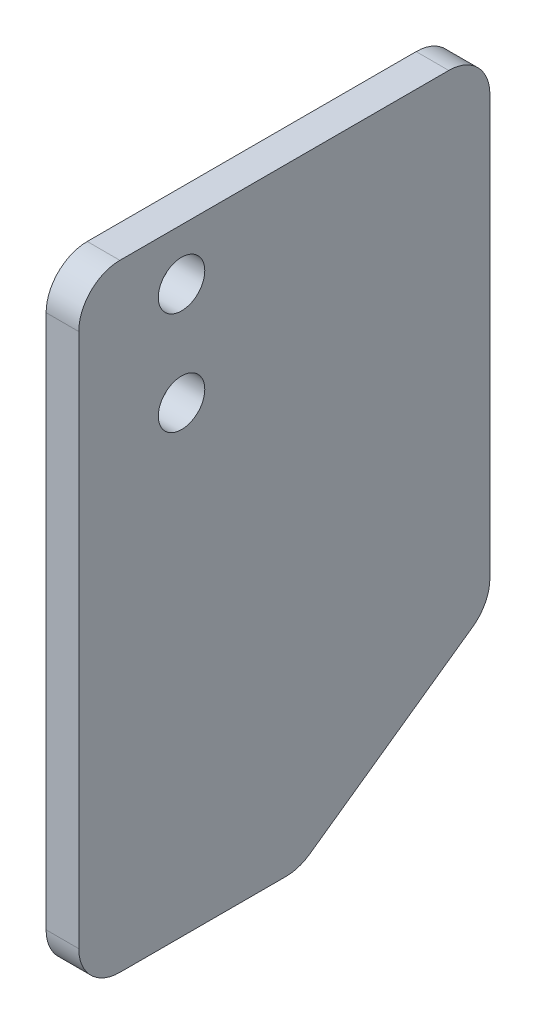
ISO-10303-21;
HEADER;
FILE_DESCRIPTION(('STEP AP214'),'2;1');
FILE_NAME('part.step','',(''),(''),'','','');
FILE_SCHEMA(('AUTOMOTIVE_DESIGN { 1 0 10303 214 1 1 1 1 }'));
ENDSEC;
DATA;
#1=APPLICATION_CONTEXT('core data for automotive mechanical design processes');
#2=APPLICATION_PROTOCOL_DEFINITION('international standard','automotive_design',2000,#1);
#3=PRODUCT_CONTEXT('',#1,'mechanical');
#4=PRODUCT('Part','Part','',(#3));
#5=PRODUCT_RELATED_PRODUCT_CATEGORY('part','',(#4));
#6=PRODUCT_DEFINITION_FORMATION('','',#4);
#7=PRODUCT_DEFINITION_CONTEXT('part definition',#1,'design');
#8=PRODUCT_DEFINITION('design','',#6,#7);
#9=PRODUCT_DEFINITION_SHAPE('','',#8);
#10=(LENGTH_UNIT() NAMED_UNIT(*) SI_UNIT(.MILLI.,.METRE.));
#11=(NAMED_UNIT(*) PLANE_ANGLE_UNIT() SI_UNIT($,.RADIAN.));
#12=(NAMED_UNIT(*) SI_UNIT($,.STERADIAN.) SOLID_ANGLE_UNIT());
#13=UNCERTAINTY_MEASURE_WITH_UNIT(LENGTH_MEASURE(1.E-05),#10,'distance_accuracy_value','');
#14=(GEOMETRIC_REPRESENTATION_CONTEXT(3) GLOBAL_UNCERTAINTY_ASSIGNED_CONTEXT((#13)) GLOBAL_UNIT_ASSIGNED_CONTEXT((#10,
#11,#12)) REPRESENTATION_CONTEXT('',''));
#15=CARTESIAN_POINT('',(0.,0.,0.));
#16=DIRECTION('',(0.,0.,1.));
#17=DIRECTION('',(1.,0.,0.));
#18=AXIS2_PLACEMENT_3D('',#15,#16,#17);
#19=CARTESIAN_POINT('',(0.79425,-38.795,-5.07828951110299));
#20=DIRECTION('',(-1.,0.,0.));
#21=DIRECTION('',(0.,0.,1.));
#22=AXIS2_PLACEMENT_3D('',#19,#20,#21);
#23=CYLINDRICAL_SURFACE('',#22,2.);
#24=CARTESIAN_POINT('',(-0.79375,-38.795,-5.07828951110299));
#25=DIRECTION('',(-1.,0.,0.));
#26=DIRECTION('',(0.,0.,1.));
#27=AXIS2_PLACEMENT_3D('',#24,#25,#26);
#28=CIRCLE('',#27,2.);
#29=CARTESIAN_POINT('',(-0.79375,-40.4279931618554,-6.23299004948226));
#30=VERTEX_POINT('',#29);
#31=CARTESIAN_POINT('',(-0.79375,-40.795,-5.07828951110299));
#32=VERTEX_POINT('',#31);
#33=EDGE_CURVE('E154',#30,#32,#28,.T.);
#34=ORIENTED_EDGE('',*,*,#33,.F.);
#35=DIRECTION('',(-1.,0.,0.));
#36=VECTOR('',#35,1.);
#37=CARTESIAN_POINT('',(0.79425,-40.4279931618554,-6.23299004948226));
#38=LINE('',#37,#36);
#39=CARTESIAN_POINT('',(0.79425,-40.4279931618554,-6.23299004948226));
#40=VERTEX_POINT('',#39);
#41=EDGE_CURVE('E11',#40,#30,#38,.T.);
#42=ORIENTED_EDGE('',*,*,#41,.F.);
#43=CARTESIAN_POINT('',(0.79425,-38.795,-5.07828951110299));
#44=DIRECTION('',(-1.,0.,0.));
#45=DIRECTION('',(0.,0.,1.));
#46=AXIS2_PLACEMENT_3D('',#43,#44,#45);
#47=CIRCLE('',#46,2.);
#48=CARTESIAN_POINT('',(0.79425,-40.795,-5.07828951110299));
#49=VERTEX_POINT('',#48);
#50=EDGE_CURVE('E191',#40,#49,#47,.T.);
#51=ORIENTED_EDGE('',*,*,#50,.T.);
#52=DIRECTION('',(-1.,0.,0.));
#53=VECTOR('',#52,1.);
#54=CARTESIAN_POINT('',(0.79425,-40.795,-5.07828951110299));
#55=LINE('',#54,#53);
#56=EDGE_CURVE('E42',#49,#32,#55,.T.);
#57=ORIENTED_EDGE('',*,*,#56,.T.);
#58=EDGE_LOOP('',(#34,#42,#51,#57));
#59=FACE_BOUND('',#58,.T.);
#60=ADVANCED_FACE('F39',(#59),#23,.T.);
#61=CARTESIAN_POINT('',(0.794250000000003,-34.8264979565598,-14.1547005383793));
#62=DIRECTION('',(0.,-0.816496580927726,-0.577350269189625));
#63=DIRECTION('',(0.,0.577350269189625,-0.816496580927726));
#64=AXIS2_PLACEMENT_3D('',#61,#62,#63);
#65=PLANE('',#64);
#66=DIRECTION('',(0.,-0.577350269189625,0.816496580927726));
#67=VECTOR('',#66,1.);
#68=CARTESIAN_POINT('',(-0.793749999999997,-34.8264979565598,-14.1547005383793));
#69=LINE('',#68,#67);
#70=CARTESIAN_POINT('',(-0.793749999999997,-34.8264979565598,-14.1547005383793));
#71=VERTEX_POINT('',#70);
#72=EDGE_CURVE('E188',#71,#30,#69,.T.);
#73=ORIENTED_EDGE('',*,*,#72,.F.);
#74=DIRECTION('',(-1.,0.,0.));
#75=VECTOR('',#74,1.);
#76=CARTESIAN_POINT('',(0.794250000000003,-34.8264979565598,-14.1547005383793));
#77=LINE('',#76,#75);
#78=CARTESIAN_POINT('',(0.794250000000003,-34.8264979565598,-14.1547005383793));
#79=VERTEX_POINT('',#78);
#80=EDGE_CURVE('E49',#79,#71,#77,.T.);
#81=ORIENTED_EDGE('',*,*,#80,.F.);
#82=DIRECTION('',(0.,-0.577350269189625,0.816496580927726));
#83=VECTOR('',#82,1.);
#84=CARTESIAN_POINT('',(0.794250000000003,-34.8264979565598,-14.1547005383793));
#85=LINE('',#84,#83);
#86=EDGE_CURVE('E140',#79,#40,#85,.T.);
#87=ORIENTED_EDGE('',*,*,#86,.T.);
#88=ORIENTED_EDGE('',*,*,#41,.T.);
#89=EDGE_LOOP('',(#73,#81,#87,#88));
#90=FACE_BOUND('',#89,.T.);
#91=ADVANCED_FACE('F215',(#90),#65,.T.);
#92=CARTESIAN_POINT('',(0.794250000000003,-33.1935047947043,-13.));
#93=DIRECTION('',(-1.,0.,0.));
#94=DIRECTION('',(0.,0.,1.));
#95=AXIS2_PLACEMENT_3D('',#92,#93,#94);
#96=CYLINDRICAL_SURFACE('',#95,2.00000000000001);
#97=CARTESIAN_POINT('',(-0.793749999999998,-33.1935047947043,-13.));
#98=DIRECTION('',(-1.,0.,0.));
#99=DIRECTION('',(0.,0.,1.));
#100=AXIS2_PLACEMENT_3D('',#97,#98,#99);
#101=CIRCLE('',#100,2.00000000000001);
#102=CARTESIAN_POINT('',(-0.793749999999997,-33.1935047947043,-15.));
#103=VERTEX_POINT('',#102);
#104=EDGE_CURVE('E126',#103,#71,#101,.T.);
#105=ORIENTED_EDGE('',*,*,#104,.F.);
#106=DIRECTION('',(-1.,0.,0.));
#107=VECTOR('',#106,1.);
#108=CARTESIAN_POINT('',(0.794250000000003,-33.1935047947043,-15.));
#109=LINE('',#108,#107);
#110=CARTESIAN_POINT('',(0.794250000000003,-33.1935047947043,-15.));
#111=VERTEX_POINT('',#110);
#112=EDGE_CURVE('E121',#111,#103,#109,.T.);
#113=ORIENTED_EDGE('',*,*,#112,.F.);
#114=CARTESIAN_POINT('',(0.794250000000003,-33.1935047947043,-13.));
#115=DIRECTION('',(-1.,0.,0.));
#116=DIRECTION('',(0.,0.,1.));
#117=AXIS2_PLACEMENT_3D('',#114,#115,#116);
#118=CIRCLE('',#117,2.00000000000001);
#119=EDGE_CURVE('E124',#111,#79,#118,.T.);
#120=ORIENTED_EDGE('',*,*,#119,.T.);
#121=ORIENTED_EDGE('',*,*,#80,.T.);
#122=EDGE_LOOP('',(#105,#113,#120,#121));
#123=FACE_BOUND('',#122,.T.);
#124=ADVANCED_FACE('F123',(#123),#96,.T.);
#125=CARTESIAN_POINT('',(0.794250000000003,-12.795,-15.));
#126=DIRECTION('',(0.,0.,-1.));
#127=DIRECTION('',(-1.,0.,0.));
#128=AXIS2_PLACEMENT_3D('',#125,#126,#127);
#129=PLANE('',#128);
#130=DIRECTION('',(0.,-1.,0.));
#131=VECTOR('',#130,1.);
#132=CARTESIAN_POINT('',(-0.793749999999997,-12.795,-15.));
#133=LINE('',#132,#131);
#134=CARTESIAN_POINT('',(-0.793749999999997,-12.795,-15.));
#135=VERTEX_POINT('',#134);
#136=EDGE_CURVE('E183',#135,#103,#133,.T.);
#137=ORIENTED_EDGE('',*,*,#136,.F.);
#138=DIRECTION('',(-1.,0.,0.));
#139=VECTOR('',#138,1.);
#140=CARTESIAN_POINT('',(0.794250000000003,-12.795,-15.));
#141=LINE('',#140,#139);
#142=CARTESIAN_POINT('',(0.794250000000003,-12.795,-15.));
#143=VERTEX_POINT('',#142);
#144=EDGE_CURVE('E132',#143,#135,#141,.T.);
#145=ORIENTED_EDGE('',*,*,#144,.F.);
#146=DIRECTION('',(0.,-1.,0.));
#147=VECTOR('',#146,1.);
#148=CARTESIAN_POINT('',(0.794250000000003,-12.795,-15.));
#149=LINE('',#148,#147);
#150=EDGE_CURVE('E138',#143,#111,#149,.T.);
#151=ORIENTED_EDGE('',*,*,#150,.T.);
#152=ORIENTED_EDGE('',*,*,#112,.T.);
#153=EDGE_LOOP('',(#137,#145,#151,#152));
#154=FACE_BOUND('',#153,.T.);
#155=ADVANCED_FACE('F143',(#154),#129,.T.);
#156=CARTESIAN_POINT('',(0.794250000000003,-12.795,-13.));
#157=DIRECTION('',(-1.,0.,0.));
#158=DIRECTION('',(0.,0.,1.));
#159=AXIS2_PLACEMENT_3D('',#156,#157,#158);
#160=CYLINDRICAL_SURFACE('',#159,2.);
#161=CARTESIAN_POINT('',(-0.793749999999998,-12.795,-13.));
#162=DIRECTION('',(-1.,0.,0.));
#163=DIRECTION('',(0.,0.,1.));
#164=AXIS2_PLACEMENT_3D('',#161,#162,#163);
#165=CIRCLE('',#164,2.);
#166=CARTESIAN_POINT('',(-0.793749999999998,-10.795,-13.));
#167=VERTEX_POINT('',#166);
#168=EDGE_CURVE('E179',#167,#135,#165,.T.);
#169=ORIENTED_EDGE('',*,*,#168,.F.);
#170=DIRECTION('',(-1.,0.,0.));
#171=VECTOR('',#170,1.);
#172=CARTESIAN_POINT('',(0.794250000000003,-10.795,-13.));
#173=LINE('',#172,#171);
#174=CARTESIAN_POINT('',(0.794250000000003,-10.795,-13.));
#175=VERTEX_POINT('',#174);
#176=EDGE_CURVE('E197',#175,#167,#173,.T.);
#177=ORIENTED_EDGE('',*,*,#176,.F.);
#178=CARTESIAN_POINT('',(0.794250000000003,-12.795,-13.));
#179=DIRECTION('',(-1.,0.,0.));
#180=DIRECTION('',(0.,0.,1.));
#181=AXIS2_PLACEMENT_3D('',#178,#179,#180);
#182=CIRCLE('',#181,2.);
#183=EDGE_CURVE('E145',#175,#143,#182,.T.);
#184=ORIENTED_EDGE('',*,*,#183,.T.);
#185=ORIENTED_EDGE('',*,*,#144,.T.);
#186=EDGE_LOOP('',(#169,#177,#184,#185));
#187=FACE_BOUND('',#186,.T.);
#188=ADVANCED_FACE('F228',(#187),#160,.T.);
#189=CARTESIAN_POINT('',(0.794249999999998,-10.795,3.));
#190=DIRECTION('',(0.,1.,0.));
#191=DIRECTION('',(0.,0.,1.));
#192=AXIS2_PLACEMENT_3D('',#189,#190,#191);
#193=PLANE('',#192);
#194=DIRECTION('',(0.,0.,-1.));
#195=VECTOR('',#194,1.);
#196=CARTESIAN_POINT('',(-0.793750000000003,-10.795,3.));
#197=LINE('',#196,#195);
#198=CARTESIAN_POINT('',(-0.793750000000003,-10.795,3.));
#199=VERTEX_POINT('',#198);
#200=EDGE_CURVE('E175',#199,#167,#197,.T.);
#201=ORIENTED_EDGE('',*,*,#200,.F.);
#202=DIRECTION('',(-1.,0.,0.));
#203=VECTOR('',#202,1.);
#204=CARTESIAN_POINT('',(0.794249999999998,-10.795,3.));
#205=LINE('',#204,#203);
#206=CARTESIAN_POINT('',(0.794249999999998,-10.795,3.));
#207=VERTEX_POINT('',#206);
#208=EDGE_CURVE('E200',#207,#199,#205,.T.);
#209=ORIENTED_EDGE('',*,*,#208,.F.);
#210=DIRECTION('',(0.,0.,-1.));
#211=VECTOR('',#210,1.);
#212=CARTESIAN_POINT('',(0.794249999999998,-10.795,3.));
#213=LINE('',#212,#211);
#214=EDGE_CURVE('E148',#207,#175,#213,.T.);
#215=ORIENTED_EDGE('',*,*,#214,.T.);
#216=ORIENTED_EDGE('',*,*,#176,.T.);
#217=EDGE_LOOP('',(#201,#209,#215,#216));
#218=FACE_BOUND('',#217,.T.);
#219=ADVANCED_FACE('F231',(#218),#193,.T.);
#220=CARTESIAN_POINT('',(0.794249999999998,-12.795,3.));
#221=DIRECTION('',(-1.,0.,0.));
#222=DIRECTION('',(0.,0.,1.));
#223=AXIS2_PLACEMENT_3D('',#220,#221,#222);
#224=CYLINDRICAL_SURFACE('',#223,2.);
#225=CARTESIAN_POINT('',(-0.793750000000003,-12.795,3.));
#226=DIRECTION('',(-1.,0.,0.));
#227=DIRECTION('',(0.,0.,1.));
#228=AXIS2_PLACEMENT_3D('',#225,#226,#227);
#229=CIRCLE('',#228,2.);
#230=CARTESIAN_POINT('',(-0.793750000000003,-12.795,5.));
#231=VERTEX_POINT('',#230);
#232=EDGE_CURVE('E171',#231,#199,#229,.T.);
#233=ORIENTED_EDGE('',*,*,#232,.F.);
#234=DIRECTION('',(-1.,0.,0.));
#235=VECTOR('',#234,1.);
#236=CARTESIAN_POINT('',(0.794249999999997,-12.795,5.));
#237=LINE('',#236,#235);
#238=CARTESIAN_POINT('',(0.794249999999997,-12.795,5.));
#239=VERTEX_POINT('',#238);
#240=EDGE_CURVE('E203',#239,#231,#237,.T.);
#241=ORIENTED_EDGE('',*,*,#240,.F.);
#242=CARTESIAN_POINT('',(0.794249999999998,-12.795,3.));
#243=DIRECTION('',(-1.,0.,0.));
#244=DIRECTION('',(0.,0.,1.));
#245=AXIS2_PLACEMENT_3D('',#242,#243,#244);
#246=CIRCLE('',#245,2.);
#247=EDGE_CURVE('E299',#239,#207,#246,.T.);
#248=ORIENTED_EDGE('',*,*,#247,.T.);
#249=ORIENTED_EDGE('',*,*,#208,.T.);
#250=EDGE_LOOP('',(#233,#241,#248,#249));
#251=FACE_BOUND('',#250,.T.);
#252=ADVANCED_FACE('F235',(#251),#224,.T.);
#253=CARTESIAN_POINT('',(0.794249999999997,-38.795,5.));
#254=DIRECTION('',(0.,0.,1.));
#255=DIRECTION('',(1.,0.,0.));
#256=AXIS2_PLACEMENT_3D('',#253,#254,#255);
#257=PLANE('',#256);
#258=DIRECTION('',(0.,1.,0.));
#259=VECTOR('',#258,1.);
#260=CARTESIAN_POINT('',(-0.793750000000003,-38.795,5.));
#261=LINE('',#260,#259);
#262=CARTESIAN_POINT('',(-0.793750000000003,-38.795,5.));
#263=VERTEX_POINT('',#262);
#264=EDGE_CURVE('E167',#263,#231,#261,.T.);
#265=ORIENTED_EDGE('',*,*,#264,.F.);
#266=DIRECTION('',(-1.,0.,0.));
#267=VECTOR('',#266,1.);
#268=CARTESIAN_POINT('',(0.794249999999997,-38.795,5.));
#269=LINE('',#268,#267);
#270=CARTESIAN_POINT('',(0.794249999999997,-38.795,5.));
#271=VERTEX_POINT('',#270);
#272=EDGE_CURVE('E206',#271,#263,#269,.T.);
#273=ORIENTED_EDGE('',*,*,#272,.F.);
#274=DIRECTION('',(0.,1.,0.));
#275=VECTOR('',#274,1.);
#276=CARTESIAN_POINT('',(0.794249999999997,-38.795,5.));
#277=LINE('',#276,#275);
#278=EDGE_CURVE('E295',#271,#239,#277,.T.);
#279=ORIENTED_EDGE('',*,*,#278,.T.);
#280=ORIENTED_EDGE('',*,*,#240,.T.);
#281=EDGE_LOOP('',(#265,#273,#279,#280));
#282=FACE_BOUND('',#281,.T.);
#283=ADVANCED_FACE('F239',(#282),#257,.T.);
#284=CARTESIAN_POINT('',(0.794249999999998,-38.795,3.));
#285=DIRECTION('',(-1.,0.,0.));
#286=DIRECTION('',(0.,0.,1.));
#287=AXIS2_PLACEMENT_3D('',#284,#285,#286);
#288=CYLINDRICAL_SURFACE('',#287,2.);
#289=CARTESIAN_POINT('',(-0.793750000000003,-38.795,3.));
#290=DIRECTION('',(-1.,0.,0.));
#291=DIRECTION('',(0.,0.,1.));
#292=AXIS2_PLACEMENT_3D('',#289,#290,#291);
#293=CIRCLE('',#292,2.);
#294=CARTESIAN_POINT('',(-0.793750000000003,-40.795,3.));
#295=VERTEX_POINT('',#294);
#296=EDGE_CURVE('E163',#295,#263,#293,.T.);
#297=ORIENTED_EDGE('',*,*,#296,.F.);
#298=DIRECTION('',(-1.,0.,0.));
#299=VECTOR('',#298,1.);
#300=CARTESIAN_POINT('',(0.794249999999998,-40.795,3.));
#301=LINE('',#300,#299);
#302=CARTESIAN_POINT('',(0.794249999999998,-40.795,3.));
#303=VERTEX_POINT('',#302);
#304=EDGE_CURVE('E208',#303,#295,#301,.T.);
#305=ORIENTED_EDGE('',*,*,#304,.F.);
#306=CARTESIAN_POINT('',(0.794249999999998,-38.795,3.));
#307=DIRECTION('',(-1.,0.,0.));
#308=DIRECTION('',(0.,0.,1.));
#309=AXIS2_PLACEMENT_3D('',#306,#307,#308);
#310=CIRCLE('',#309,2.);
#311=EDGE_CURVE('E291',#303,#271,#310,.T.);
#312=ORIENTED_EDGE('',*,*,#311,.T.);
#313=ORIENTED_EDGE('',*,*,#272,.T.);
#314=EDGE_LOOP('',(#297,#305,#312,#313));
#315=FACE_BOUND('',#314,.T.);
#316=ADVANCED_FACE('F243',(#315),#288,.T.);
#317=CARTESIAN_POINT('',(0.79425,-40.795,-5.07828951110299));
#318=DIRECTION('',(0.,-1.,0.));
#319=DIRECTION('',(0.,0.,-1.));
#320=AXIS2_PLACEMENT_3D('',#317,#318,#319);
#321=PLANE('',#320);
#322=DIRECTION('',(0.,0.,1.));
#323=VECTOR('',#322,1.);
#324=CARTESIAN_POINT('',(-0.79375,-40.795,-5.07828951110299));
#325=LINE('',#324,#323);
#326=EDGE_CURVE('E158',#32,#295,#325,.T.);
#327=ORIENTED_EDGE('',*,*,#326,.F.);
#328=ORIENTED_EDGE('',*,*,#56,.F.);
#329=DIRECTION('',(0.,0.,1.));
#330=VECTOR('',#329,1.);
#331=CARTESIAN_POINT('',(0.79425,-40.795,-5.07828951110299));
#332=LINE('',#331,#330);
#333=EDGE_CURVE('E288',#49,#303,#332,.T.);
#334=ORIENTED_EDGE('',*,*,#333,.T.);
#335=ORIENTED_EDGE('',*,*,#304,.T.);
#336=EDGE_LOOP('',(#327,#328,#334,#335));
#337=FACE_BOUND('',#336,.T.);
#338=ADVANCED_FACE('F212',(#337),#321,.T.);
#339=CARTESIAN_POINT('',(0.79425,-38.795,-5.07828951110299));
#340=DIRECTION('',(-1.,0.,0.));
#341=DIRECTION('',(0.,0.,1.));
#342=AXIS2_PLACEMENT_3D('',#339,#340,#341);
#343=PLANE('',#342);
#344=CARTESIAN_POINT('',(0.794249999999999,-13.295,0.));
#345=DIRECTION('',(-1.,0.,0.));
#346=DIRECTION('',(0.,0.,-1.));
#347=AXIS2_PLACEMENT_3D('',#344,#345,#346);
#348=CIRCLE('',#347,1.1303);
#349=CARTESIAN_POINT('',(0.794249999999999,-13.295,-1.1303));
#350=VERTEX_POINT('',#349);
#351=EDGE_CURVE('E270',#350,#350,#348,.T.);
#352=ORIENTED_EDGE('',*,*,#351,.T.);
#353=EDGE_LOOP('',(#352));
#354=FACE_BOUND('',#353,.T.);
#355=CARTESIAN_POINT('',(0.794249999999999,-18.295,0.));
#356=DIRECTION('',(-1.,0.,0.));
#357=DIRECTION('',(0.,0.,-1.));
#358=AXIS2_PLACEMENT_3D('',#355,#356,#357);
#359=CIRCLE('',#358,1.1303);
#360=CARTESIAN_POINT('',(0.794249999999999,-18.295,-1.1303));
#361=VERTEX_POINT('',#360);
#362=EDGE_CURVE('E159',#361,#361,#359,.T.);
#363=ORIENTED_EDGE('',*,*,#362,.T.);
#364=EDGE_LOOP('',(#363));
#365=FACE_BOUND('',#364,.T.);
#366=ORIENTED_EDGE('',*,*,#50,.F.);
#367=ORIENTED_EDGE('',*,*,#86,.F.);
#368=ORIENTED_EDGE('',*,*,#119,.F.);
#369=ORIENTED_EDGE('',*,*,#150,.F.);
#370=ORIENTED_EDGE('',*,*,#183,.F.);
#371=ORIENTED_EDGE('',*,*,#214,.F.);
#372=ORIENTED_EDGE('',*,*,#247,.F.);
#373=ORIENTED_EDGE('',*,*,#278,.F.);
#374=ORIENTED_EDGE('',*,*,#311,.F.);
#375=ORIENTED_EDGE('',*,*,#333,.F.);
#376=EDGE_LOOP('',(#366,#367,#368,#369,#370,#371,#372,#373,#374,#375));
#377=FACE_BOUND('',#376,.T.);
#378=ADVANCED_FACE('F136',(#354,#365,#377),#343,.F.);
#379=CARTESIAN_POINT('',(-0.79375,-38.795,-5.07828951110299));
#380=DIRECTION('',(-1.,0.,0.));
#381=DIRECTION('',(0.,0.,1.));
#382=AXIS2_PLACEMENT_3D('',#379,#380,#381);
#383=PLANE('',#382);
#384=CARTESIAN_POINT('',(-0.793750000000002,-13.295,0.));
#385=DIRECTION('',(-1.,0.,0.));
#386=DIRECTION('',(0.,0.,-1.));
#387=AXIS2_PLACEMENT_3D('',#384,#385,#386);
#388=CIRCLE('',#387,1.1303);
#389=CARTESIAN_POINT('',(-0.793750000000001,-13.295,-1.1303));
#390=VERTEX_POINT('',#389);
#391=EDGE_CURVE('E273',#390,#390,#388,.T.);
#392=ORIENTED_EDGE('',*,*,#391,.F.);
#393=EDGE_LOOP('',(#392));
#394=FACE_BOUND('',#393,.T.);
#395=CARTESIAN_POINT('',(-0.793750000000002,-18.295,0.));
#396=DIRECTION('',(-1.,0.,0.));
#397=DIRECTION('',(0.,0.,-1.));
#398=AXIS2_PLACEMENT_3D('',#395,#396,#397);
#399=CIRCLE('',#398,1.1303);
#400=CARTESIAN_POINT('',(-0.793750000000001,-18.295,-1.1303));
#401=VERTEX_POINT('',#400);
#402=EDGE_CURVE('E277',#401,#401,#399,.T.);
#403=ORIENTED_EDGE('',*,*,#402,.F.);
#404=EDGE_LOOP('',(#403));
#405=FACE_BOUND('',#404,.T.);
#406=ORIENTED_EDGE('',*,*,#33,.T.);
#407=ORIENTED_EDGE('',*,*,#326,.T.);
#408=ORIENTED_EDGE('',*,*,#296,.T.);
#409=ORIENTED_EDGE('',*,*,#264,.T.);
#410=ORIENTED_EDGE('',*,*,#232,.T.);
#411=ORIENTED_EDGE('',*,*,#200,.T.);
#412=ORIENTED_EDGE('',*,*,#168,.T.);
#413=ORIENTED_EDGE('',*,*,#136,.T.);
#414=ORIENTED_EDGE('',*,*,#104,.T.);
#415=ORIENTED_EDGE('',*,*,#72,.T.);
#416=EDGE_LOOP('',(#406,#407,#408,#409,#410,#411,#412,#413,#414,#415));
#417=FACE_BOUND('',#416,.T.);
#418=ADVANCED_FACE('F214',(#394,#405,#417),#383,.T.);
#419=CARTESIAN_POINT('',(0.794249999999999,-18.295,0.));
#420=DIRECTION('',(-1.,0.,0.));
#421=DIRECTION('',(0.,0.,1.));
#422=AXIS2_PLACEMENT_3D('',#419,#420,#421);
#423=CYLINDRICAL_SURFACE('',#422,1.1303);
#424=ORIENTED_EDGE('',*,*,#362,.F.);
#425=EDGE_LOOP('',(#424));
#426=FACE_BOUND('',#425,.T.);
#427=ORIENTED_EDGE('',*,*,#402,.T.);
#428=EDGE_LOOP('',(#427));
#429=FACE_BOUND('',#428,.T.);
#430=ADVANCED_FACE('F255',(#426,#429),#423,.F.);
#431=CARTESIAN_POINT('',(0.794249999999999,-13.295,0.));
#432=DIRECTION('',(-1.,0.,0.));
#433=DIRECTION('',(0.,0.,1.));
#434=AXIS2_PLACEMENT_3D('',#431,#432,#433);
#435=CYLINDRICAL_SURFACE('',#434,1.1303);
#436=ORIENTED_EDGE('',*,*,#351,.F.);
#437=EDGE_LOOP('',(#436));
#438=FACE_BOUND('',#437,.T.);
#439=ORIENTED_EDGE('',*,*,#391,.T.);
#440=EDGE_LOOP('',(#439));
#441=FACE_BOUND('',#440,.T.);
#442=ADVANCED_FACE('F262',(#438,#441),#435,.F.);
#443=CLOSED_SHELL('',(#60,#91,#124,#155,#188,#219,#252,#283,#316,#338,#378,#418,#430,#442));
#444=MANIFOLD_SOLID_BREP('B2',#443);
#445=ADVANCED_BREP_SHAPE_REPRESENTATION('',(#18,#444),#14);
#446=SHAPE_DEFINITION_REPRESENTATION(#9,#445);
ENDSEC;
END-ISO-10303-21;
